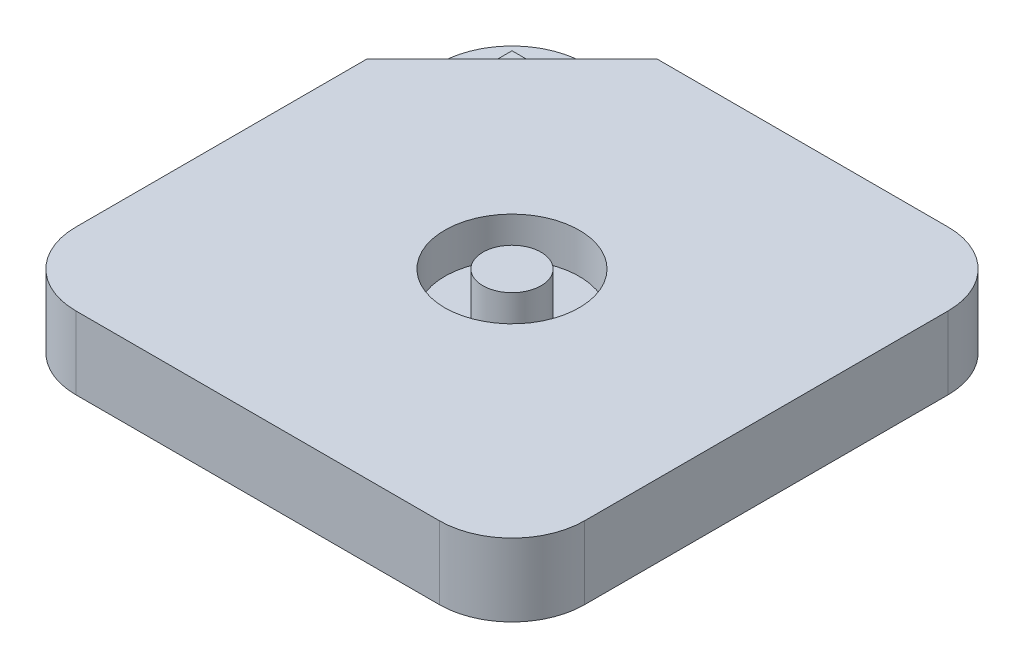
ISO-10303-21;
HEADER;
FILE_DESCRIPTION(('STEP AP214'),'2;1');
FILE_NAME('part.step','',(''),(''),'','','');
FILE_SCHEMA(('AUTOMOTIVE_DESIGN { 1 0 10303 214 1 1 1 1 }'));
ENDSEC;
DATA;
#1=APPLICATION_CONTEXT('core data for automotive mechanical design processes');
#2=APPLICATION_PROTOCOL_DEFINITION('international standard','automotive_design',2000,#1);
#3=PRODUCT_CONTEXT('',#1,'mechanical');
#4=PRODUCT('Part','Part','',(#3));
#5=PRODUCT_RELATED_PRODUCT_CATEGORY('part','',(#4));
#6=PRODUCT_DEFINITION_FORMATION('','',#4);
#7=PRODUCT_DEFINITION_CONTEXT('part definition',#1,'design');
#8=PRODUCT_DEFINITION('design','',#6,#7);
#9=PRODUCT_DEFINITION_SHAPE('','',#8);
#10=(LENGTH_UNIT() NAMED_UNIT(*) SI_UNIT(.MILLI.,.METRE.));
#11=(NAMED_UNIT(*) PLANE_ANGLE_UNIT() SI_UNIT($,.RADIAN.));
#12=(NAMED_UNIT(*) SI_UNIT($,.STERADIAN.) SOLID_ANGLE_UNIT());
#13=UNCERTAINTY_MEASURE_WITH_UNIT(LENGTH_MEASURE(1.E-05),#10,'distance_accuracy_value','');
#14=(GEOMETRIC_REPRESENTATION_CONTEXT(3) GLOBAL_UNCERTAINTY_ASSIGNED_CONTEXT((#13)) GLOBAL_UNIT_ASSIGNED_CONTEXT((#10,
#11,#12)) REPRESENTATION_CONTEXT('',''));
#15=CARTESIAN_POINT('',(0.,0.,0.));
#16=DIRECTION('',(0.,0.,1.));
#17=DIRECTION('',(1.,0.,0.));
#18=AXIS2_PLACEMENT_3D('',#15,#16,#17);
#19=CARTESIAN_POINT('',(-15.,4.5,-35.));
#20=DIRECTION('',(0.707106781186548,0.,0.707106781186548));
#21=DIRECTION('',(0.707106781186548,0.,-0.707106781186548));
#22=AXIS2_PLACEMENT_3D('',#19,#20,#21);
#23=PLANE('',#22);
#24=DIRECTION('',(0.,-1.,0.));
#25=VECTOR('',#24,1.);
#26=CARTESIAN_POINT('',(-23.,9.,-27.));
#27=LINE('',#26,#25);
#28=CARTESIAN_POINT('',(-23.,9.,-27.));
#29=VERTEX_POINT('',#28);
#30=CARTESIAN_POINT('',(-23.,4.5,-27.));
#31=VERTEX_POINT('',#30);
#32=EDGE_CURVE('E148',#29,#31,#27,.T.);
#33=ORIENTED_EDGE('',*,*,#32,.F.);
#34=DIRECTION('',(0.707106781186548,0.,-0.707106781186547));
#35=VECTOR('',#34,1.);
#36=CARTESIAN_POINT('',(-27.,9.,-23.));
#37=LINE('',#36,#35);
#38=CARTESIAN_POINT('',(-27.,9.,-23.));
#39=VERTEX_POINT('',#38);
#40=EDGE_CURVE('E137',#39,#29,#37,.T.);
#41=ORIENTED_EDGE('',*,*,#40,.F.);
#42=DIRECTION('',(0.,-1.,0.));
#43=VECTOR('',#42,1.);
#44=CARTESIAN_POINT('',(-27.,9.,-23.));
#45=LINE('',#44,#43);
#46=CARTESIAN_POINT('',(-27.,4.5,-23.));
#47=VERTEX_POINT('',#46);
#48=EDGE_CURVE('E149',#39,#47,#45,.T.);
#49=ORIENTED_EDGE('',*,*,#48,.T.);
#50=DIRECTION('',(0.707106781186548,0.,-0.707106781186548));
#51=VECTOR('',#50,1.);
#52=CARTESIAN_POINT('',(-15.,4.5,-35.));
#53=LINE('',#52,#51);
#54=CARTESIAN_POINT('',(-35.,4.5,-15.));
#55=VERTEX_POINT('',#54);
#56=EDGE_CURVE('E165',#55,#47,#53,.T.);
#57=ORIENTED_EDGE('',*,*,#56,.F.);
#58=DIRECTION('',(0.,1.,0.));
#59=VECTOR('',#58,1.);
#60=CARTESIAN_POINT('',(-35.,4.5,-15.));
#61=LINE('',#60,#59);
#62=CARTESIAN_POINT('',(-35.,10.,-15.));
#63=VERTEX_POINT('',#62);
#64=EDGE_CURVE('E169',#55,#63,#61,.T.);
#65=ORIENTED_EDGE('',*,*,#64,.T.);
#66=DIRECTION('',(0.707106781186548,0.,-0.707106781186548));
#67=VECTOR('',#66,1.);
#68=CARTESIAN_POINT('',(-15.,10.,-35.));
#69=LINE('',#68,#67);
#70=CARTESIAN_POINT('',(-15.,10.,-35.));
#71=VERTEX_POINT('',#70);
#72=EDGE_CURVE('E161',#63,#71,#69,.T.);
#73=ORIENTED_EDGE('',*,*,#72,.T.);
#74=DIRECTION('',(0.,1.,0.));
#75=VECTOR('',#74,1.);
#76=CARTESIAN_POINT('',(-15.,4.5,-35.));
#77=LINE('',#76,#75);
#78=CARTESIAN_POINT('',(-15.,4.5,-35.));
#79=VERTEX_POINT('',#78);
#80=EDGE_CURVE('E172',#79,#71,#77,.T.);
#81=ORIENTED_EDGE('',*,*,#80,.F.);
#82=EDGE_CURVE('E164',#31,#79,#53,.T.);
#83=ORIENTED_EDGE('',*,*,#82,.F.);
#84=EDGE_LOOP('',(#33,#41,#49,#57,#65,#73,#81,#83));
#85=FACE_BOUND('',#84,.T.);
#86=ADVANCED_FACE('F33',(#85),#23,.F.);
#87=CARTESIAN_POINT('',(0.,4.5,0.));
#88=DIRECTION('',(0.,-1.,0.));
#89=DIRECTION('',(0.,0.,-1.));
#90=AXIS2_PLACEMENT_3D('',#87,#88,#89);
#91=PLANE('',#90);
#92=DIRECTION('',(-1.,0.,0.));
#93=VECTOR('',#92,1.);
#94=CARTESIAN_POINT('',(-35.,4.5,-35.));
#95=LINE('',#94,#93);
#96=CARTESIAN_POINT('',(-25.,4.5,-35.));
#97=VERTEX_POINT('',#96);
#98=EDGE_CURVE('E167',#79,#97,#95,.T.);
#99=ORIENTED_EDGE('',*,*,#98,.T.);
#100=CARTESIAN_POINT('',(-25.,4.5,-25.));
#101=DIRECTION('',(0.,-1.,0.));
#102=DIRECTION('',(0.,0.,-1.));
#103=AXIS2_PLACEMENT_3D('',#100,#101,#102);
#104=CIRCLE('',#103,10.);
#105=CARTESIAN_POINT('',(-35.,4.5,-25.));
#106=VERTEX_POINT('',#105);
#107=EDGE_CURVE('E11',#97,#106,#104,.F.);
#108=ORIENTED_EDGE('',*,*,#107,.T.);
#109=DIRECTION('',(0.,0.,1.));
#110=VECTOR('',#109,1.);
#111=CARTESIAN_POINT('',(-35.,4.5,-15.));
#112=LINE('',#111,#110);
#113=EDGE_CURVE('E162',#106,#55,#112,.T.);
#114=ORIENTED_EDGE('',*,*,#113,.T.);
#115=ORIENTED_EDGE('',*,*,#56,.T.);
#116=DIRECTION('',(0.,0.,1.));
#117=VECTOR('',#116,1.);
#118=CARTESIAN_POINT('',(-27.,4.5,-27.));
#119=LINE('',#118,#117);
#120=CARTESIAN_POINT('',(-27.,4.5,-27.));
#121=VERTEX_POINT('',#120);
#122=EDGE_CURVE('E158',#121,#47,#119,.T.);
#123=ORIENTED_EDGE('',*,*,#122,.F.);
#124=DIRECTION('',(-1.,0.,0.));
#125=VECTOR('',#124,1.);
#126=CARTESIAN_POINT('',(-23.,4.5,-27.));
#127=LINE('',#126,#125);
#128=EDGE_CURVE('E145',#31,#121,#127,.T.);
#129=ORIENTED_EDGE('',*,*,#128,.F.);
#130=ORIENTED_EDGE('',*,*,#82,.T.);
#131=EDGE_LOOP('',(#99,#108,#114,#115,#123,#129,#130));
#132=FACE_BOUND('',#131,.T.);
#133=ADVANCED_FACE('F258',(#132),#91,.F.);
#134=CARTESIAN_POINT('',(35.,10.,-35.));
#135=DIRECTION('',(-1.,0.,0.));
#136=DIRECTION('',(0.,0.,1.));
#137=AXIS2_PLACEMENT_3D('',#134,#135,#136);
#138=PLANE('',#137);
#139=DIRECTION('',(0.,0.,-1.));
#140=VECTOR('',#139,1.);
#141=CARTESIAN_POINT('',(35.,10.,-35.));
#142=LINE('',#141,#140);
#143=CARTESIAN_POINT('',(35.,10.,25.));
#144=VERTEX_POINT('',#143);
#145=CARTESIAN_POINT('',(35.,10.,-25.));
#146=VERTEX_POINT('',#145);
#147=EDGE_CURVE('E189',#144,#146,#142,.T.);
#148=ORIENTED_EDGE('',*,*,#147,.F.);
#149=DIRECTION('',(0.,-1.,0.));
#150=VECTOR('',#149,1.);
#151=CARTESIAN_POINT('',(35.,10.,25.));
#152=LINE('',#151,#150);
#153=CARTESIAN_POINT('',(35.,0.,25.));
#154=VERTEX_POINT('',#153);
#155=EDGE_CURVE('E234',#144,#154,#152,.T.);
#156=ORIENTED_EDGE('',*,*,#155,.T.);
#157=DIRECTION('',(0.,0.,-1.));
#158=VECTOR('',#157,1.);
#159=CARTESIAN_POINT('',(35.,0.,-35.));
#160=LINE('',#159,#158);
#161=CARTESIAN_POINT('',(35.,0.,-25.));
#162=VERTEX_POINT('',#161);
#163=EDGE_CURVE('E186',#154,#162,#160,.T.);
#164=ORIENTED_EDGE('',*,*,#163,.T.);
#165=DIRECTION('',(0.,-1.,0.));
#166=VECTOR('',#165,1.);
#167=CARTESIAN_POINT('',(35.,10.,-25.));
#168=LINE('',#167,#166);
#169=EDGE_CURVE('E232',#162,#146,#168,.F.);
#170=ORIENTED_EDGE('',*,*,#169,.T.);
#171=EDGE_LOOP('',(#148,#156,#164,#170));
#172=FACE_BOUND('',#171,.T.);
#173=ADVANCED_FACE('F279',(#172),#138,.F.);
#174=CARTESIAN_POINT('',(-35.,10.,-35.));
#175=DIRECTION('',(0.,0.,1.));
#176=DIRECTION('',(1.,0.,0.));
#177=AXIS2_PLACEMENT_3D('',#174,#175,#176);
#178=PLANE('',#177);
#179=DIRECTION('',(-1.,0.,0.));
#180=VECTOR('',#179,1.);
#181=CARTESIAN_POINT('',(-35.,10.,-35.));
#182=LINE('',#181,#180);
#183=CARTESIAN_POINT('',(25.,10.,-35.));
#184=VERTEX_POINT('',#183);
#185=EDGE_CURVE('E191',#184,#71,#182,.T.);
#186=ORIENTED_EDGE('',*,*,#185,.F.);
#187=DIRECTION('',(0.,-1.,0.));
#188=VECTOR('',#187,1.);
#189=CARTESIAN_POINT('',(25.,10.,-35.));
#190=LINE('',#189,#188);
#191=CARTESIAN_POINT('',(25.,0.,-35.));
#192=VERTEX_POINT('',#191);
#193=EDGE_CURVE('E41',#184,#192,#190,.T.);
#194=ORIENTED_EDGE('',*,*,#193,.T.);
#195=DIRECTION('',(-1.,0.,0.));
#196=VECTOR('',#195,1.);
#197=CARTESIAN_POINT('',(-35.,0.,-35.));
#198=LINE('',#197,#196);
#199=CARTESIAN_POINT('',(-25.,0.,-35.));
#200=VERTEX_POINT('',#199);
#201=EDGE_CURVE('E203',#192,#200,#198,.T.);
#202=ORIENTED_EDGE('',*,*,#201,.T.);
#203=DIRECTION('',(0.,-1.,0.));
#204=VECTOR('',#203,1.);
#205=CARTESIAN_POINT('',(-25.,10.,-35.));
#206=LINE('',#205,#204);
#207=EDGE_CURVE('E48',#200,#97,#206,.F.);
#208=ORIENTED_EDGE('',*,*,#207,.T.);
#209=ORIENTED_EDGE('',*,*,#98,.F.);
#210=ORIENTED_EDGE('',*,*,#80,.T.);
#211=EDGE_LOOP('',(#186,#194,#202,#208,#209,#210));
#212=FACE_BOUND('',#211,.T.);
#213=ADVANCED_FACE('F240',(#212),#178,.F.);
#214=CARTESIAN_POINT('',(-35.,10.,-35.));
#215=DIRECTION('',(1.,0.,0.));
#216=DIRECTION('',(0.,0.,-1.));
#217=AXIS2_PLACEMENT_3D('',#214,#215,#216);
#218=PLANE('',#217);
#219=DIRECTION('',(0.,0.,1.));
#220=VECTOR('',#219,1.);
#221=CARTESIAN_POINT('',(-35.,0.,-35.));
#222=LINE('',#221,#220);
#223=CARTESIAN_POINT('',(-35.,0.,-25.));
#224=VERTEX_POINT('',#223);
#225=CARTESIAN_POINT('',(-35.,0.,25.));
#226=VERTEX_POINT('',#225);
#227=EDGE_CURVE('E205',#224,#226,#222,.T.);
#228=ORIENTED_EDGE('',*,*,#227,.T.);
#229=DIRECTION('',(0.,-1.,0.));
#230=VECTOR('',#229,1.);
#231=CARTESIAN_POINT('',(-35.,10.,25.));
#232=LINE('',#231,#230);
#233=CARTESIAN_POINT('',(-35.,10.,25.));
#234=VERTEX_POINT('',#233);
#235=EDGE_CURVE('E225',#226,#234,#232,.F.);
#236=ORIENTED_EDGE('',*,*,#235,.T.);
#237=DIRECTION('',(0.,0.,1.));
#238=VECTOR('',#237,1.);
#239=CARTESIAN_POINT('',(-35.,10.,-35.));
#240=LINE('',#239,#238);
#241=EDGE_CURVE('E194',#63,#234,#240,.T.);
#242=ORIENTED_EDGE('',*,*,#241,.F.);
#243=ORIENTED_EDGE('',*,*,#64,.F.);
#244=ORIENTED_EDGE('',*,*,#113,.F.);
#245=DIRECTION('',(0.,-1.,0.));
#246=VECTOR('',#245,1.);
#247=CARTESIAN_POINT('',(-35.,10.,-25.));
#248=LINE('',#247,#246);
#249=EDGE_CURVE('E222',#106,#224,#248,.T.);
#250=ORIENTED_EDGE('',*,*,#249,.T.);
#251=EDGE_LOOP('',(#228,#236,#242,#243,#244,#250));
#252=FACE_BOUND('',#251,.T.);
#253=ADVANCED_FACE('F252',(#252),#218,.F.);
#254=CARTESIAN_POINT('',(-35.,10.,35.));
#255=DIRECTION('',(0.,0.,-1.));
#256=DIRECTION('',(-1.,0.,0.));
#257=AXIS2_PLACEMENT_3D('',#254,#255,#256);
#258=PLANE('',#257);
#259=DIRECTION('',(1.,0.,0.));
#260=VECTOR('',#259,1.);
#261=CARTESIAN_POINT('',(-35.,10.,35.));
#262=LINE('',#261,#260);
#263=CARTESIAN_POINT('',(-25.,10.,35.));
#264=VERTEX_POINT('',#263);
#265=CARTESIAN_POINT('',(25.,10.,35.));
#266=VERTEX_POINT('',#265);
#267=EDGE_CURVE('E197',#264,#266,#262,.T.);
#268=ORIENTED_EDGE('',*,*,#267,.F.);
#269=DIRECTION('',(0.,-1.,0.));
#270=VECTOR('',#269,1.);
#271=CARTESIAN_POINT('',(-25.,10.,35.));
#272=LINE('',#271,#270);
#273=CARTESIAN_POINT('',(-25.,0.,35.));
#274=VERTEX_POINT('',#273);
#275=EDGE_CURVE('E211',#264,#274,#272,.T.);
#276=ORIENTED_EDGE('',*,*,#275,.T.);
#277=DIRECTION('',(1.,0.,0.));
#278=VECTOR('',#277,1.);
#279=CARTESIAN_POINT('',(-35.,0.,35.));
#280=LINE('',#279,#278);
#281=CARTESIAN_POINT('',(25.,0.,35.));
#282=VERTEX_POINT('',#281);
#283=EDGE_CURVE('E192',#274,#282,#280,.T.);
#284=ORIENTED_EDGE('',*,*,#283,.T.);
#285=DIRECTION('',(0.,-1.,0.));
#286=VECTOR('',#285,1.);
#287=CARTESIAN_POINT('',(25.,10.,35.));
#288=LINE('',#287,#286);
#289=EDGE_CURVE('E200',#282,#266,#288,.F.);
#290=ORIENTED_EDGE('',*,*,#289,.T.);
#291=EDGE_LOOP('',(#268,#276,#284,#290));
#292=FACE_BOUND('',#291,.T.);
#293=ADVANCED_FACE('F272',(#292),#258,.F.);
#294=CARTESIAN_POINT('',(0.,10.,0.));
#295=DIRECTION('',(0.,1.,0.));
#296=DIRECTION('',(0.,0.,1.));
#297=AXIS2_PLACEMENT_3D('',#294,#295,#296);
#298=PLANE('',#297);
#299=ORIENTED_EDGE('',*,*,#241,.T.);
#300=CARTESIAN_POINT('',(-25.,10.,25.));
#301=DIRECTION('',(0.,1.,0.));
#302=DIRECTION('',(0.,0.,1.));
#303=AXIS2_PLACEMENT_3D('',#300,#301,#302);
#304=CIRCLE('',#303,10.);
#305=EDGE_CURVE('E230',#234,#264,#304,.T.);
#306=ORIENTED_EDGE('',*,*,#305,.T.);
#307=ORIENTED_EDGE('',*,*,#267,.T.);
#308=CARTESIAN_POINT('',(25.,10.,25.));
#309=DIRECTION('',(0.,1.,0.));
#310=DIRECTION('',(0.,0.,1.));
#311=AXIS2_PLACEMENT_3D('',#308,#309,#310);
#312=CIRCLE('',#311,10.);
#313=EDGE_CURVE('E228',#266,#144,#312,.T.);
#314=ORIENTED_EDGE('',*,*,#313,.T.);
#315=ORIENTED_EDGE('',*,*,#147,.T.);
#316=CARTESIAN_POINT('',(25.,10.,-25.));
#317=DIRECTION('',(0.,1.,0.));
#318=DIRECTION('',(0.,0.,1.));
#319=AXIS2_PLACEMENT_3D('',#316,#317,#318);
#320=CIRCLE('',#319,10.);
#321=EDGE_CURVE('E56',#146,#184,#320,.T.);
#322=ORIENTED_EDGE('',*,*,#321,.T.);
#323=ORIENTED_EDGE('',*,*,#185,.T.);
#324=ORIENTED_EDGE('',*,*,#72,.F.);
#325=EDGE_LOOP('',(#299,#306,#307,#314,#315,#322,#323,#324));
#326=FACE_BOUND('',#325,.T.);
#327=CARTESIAN_POINT('',(0.,10.,0.));
#328=DIRECTION('',(0.,1.,0.));
#329=DIRECTION('',(0.,0.,1.));
#330=AXIS2_PLACEMENT_3D('',#327,#328,#329);
#331=CIRCLE('',#330,9.25);
#332=CARTESIAN_POINT('',(0.,10.,9.25));
#333=VERTEX_POINT('',#332);
#334=EDGE_CURVE('E180',#333,#333,#331,.T.);
#335=ORIENTED_EDGE('',*,*,#334,.F.);
#336=EDGE_LOOP('',(#335));
#337=FACE_BOUND('',#336,.T.);
#338=ADVANCED_FACE('F263',(#326,#337),#298,.T.);
#339=CARTESIAN_POINT('',(0.,0.,0.));
#340=DIRECTION('',(0.,1.,0.));
#341=DIRECTION('',(0.,0.,1.));
#342=AXIS2_PLACEMENT_3D('',#339,#340,#341);
#343=PLANE('',#342);
#344=ORIENTED_EDGE('',*,*,#283,.F.);
#345=CARTESIAN_POINT('',(-25.,0.,25.));
#346=DIRECTION('',(0.,1.,0.));
#347=DIRECTION('',(0.,0.,1.));
#348=AXIS2_PLACEMENT_3D('',#345,#346,#347);
#349=CIRCLE('',#348,10.);
#350=EDGE_CURVE('E220',#274,#226,#349,.F.);
#351=ORIENTED_EDGE('',*,*,#350,.T.);
#352=ORIENTED_EDGE('',*,*,#227,.F.);
#353=CARTESIAN_POINT('',(-25.,0.,-25.));
#354=DIRECTION('',(0.,1.,0.));
#355=DIRECTION('',(0.,0.,1.));
#356=AXIS2_PLACEMENT_3D('',#353,#354,#355);
#357=CIRCLE('',#356,10.);
#358=EDGE_CURVE('E214',#224,#200,#357,.F.);
#359=ORIENTED_EDGE('',*,*,#358,.T.);
#360=ORIENTED_EDGE('',*,*,#201,.F.);
#361=CARTESIAN_POINT('',(25.,0.,-25.));
#362=DIRECTION('',(0.,1.,0.));
#363=DIRECTION('',(0.,0.,1.));
#364=AXIS2_PLACEMENT_3D('',#361,#362,#363);
#365=CIRCLE('',#364,10.);
#366=EDGE_CURVE('E216',#192,#162,#365,.F.);
#367=ORIENTED_EDGE('',*,*,#366,.T.);
#368=ORIENTED_EDGE('',*,*,#163,.F.);
#369=CARTESIAN_POINT('',(25.,0.,25.));
#370=DIRECTION('',(0.,1.,0.));
#371=DIRECTION('',(0.,0.,1.));
#372=AXIS2_PLACEMENT_3D('',#369,#370,#371);
#373=CIRCLE('',#372,10.);
#374=EDGE_CURVE('E218',#154,#282,#373,.F.);
#375=ORIENTED_EDGE('',*,*,#374,.T.);
#376=EDGE_LOOP('',(#344,#351,#352,#359,#360,#367,#368,#375));
#377=FACE_BOUND('',#376,.T.);
#378=ADVANCED_FACE('F244',(#377),#343,.F.);
#379=CARTESIAN_POINT('',(0.,4.5,0.));
#380=DIRECTION('',(0.,1.,0.));
#381=DIRECTION('',(0.,0.,1.));
#382=AXIS2_PLACEMENT_3D('',#379,#380,#381);
#383=CYLINDRICAL_SURFACE('',#382,9.25);
#384=CARTESIAN_POINT('',(0.,4.5,0.));
#385=DIRECTION('',(0.,1.,0.));
#386=DIRECTION('',(0.,0.,1.));
#387=AXIS2_PLACEMENT_3D('',#384,#385,#386);
#388=CIRCLE('',#387,9.25);
#389=CARTESIAN_POINT('',(0.,4.5,9.25));
#390=VERTEX_POINT('',#389);
#391=EDGE_CURVE('E183',#390,#390,#388,.T.);
#392=ORIENTED_EDGE('',*,*,#391,.F.);
#393=EDGE_LOOP('',(#392));
#394=FACE_BOUND('',#393,.T.);
#395=ORIENTED_EDGE('',*,*,#334,.T.);
#396=EDGE_LOOP('',(#395));
#397=FACE_BOUND('',#396,.T.);
#398=ADVANCED_FACE('F308',(#394,#397),#383,.F.);
#399=CARTESIAN_POINT('',(0.,4.5,0.));
#400=DIRECTION('',(0.,1.,0.));
#401=DIRECTION('',(0.,0.,1.));
#402=AXIS2_PLACEMENT_3D('',#399,#400,#401);
#403=PLANE('',#402);
#404=CARTESIAN_POINT('',(0.,4.5,0.));
#405=DIRECTION('',(0.,1.,0.));
#406=DIRECTION('',(0.,0.,1.));
#407=AXIS2_PLACEMENT_3D('',#404,#405,#406);
#408=CIRCLE('',#407,4.);
#409=CARTESIAN_POINT('',(0.,4.5,4.));
#410=VERTEX_POINT('',#409);
#411=EDGE_CURVE('E175',#410,#410,#408,.T.);
#412=ORIENTED_EDGE('',*,*,#411,.F.);
#413=EDGE_LOOP('',(#412));
#414=FACE_BOUND('',#413,.T.);
#415=ORIENTED_EDGE('',*,*,#391,.T.);
#416=EDGE_LOOP('',(#415));
#417=FACE_BOUND('',#416,.T.);
#418=ADVANCED_FACE('F304',(#414,#417),#403,.T.);
#419=CARTESIAN_POINT('',(0.,10.,0.));
#420=DIRECTION('',(0.,-1.,0.));
#421=DIRECTION('',(0.,0.,-1.));
#422=AXIS2_PLACEMENT_3D('',#419,#420,#421);
#423=CYLINDRICAL_SURFACE('',#422,4.);
#424=CARTESIAN_POINT('',(0.,10.,0.));
#425=DIRECTION('',(0.,1.,0.));
#426=DIRECTION('',(0.,0.,1.));
#427=AXIS2_PLACEMENT_3D('',#424,#425,#426);
#428=CIRCLE('',#427,4.);
#429=CARTESIAN_POINT('',(0.,10.,4.));
#430=VERTEX_POINT('',#429);
#431=EDGE_CURVE('E177',#430,#430,#428,.T.);
#432=ORIENTED_EDGE('',*,*,#431,.F.);
#433=EDGE_LOOP('',(#432));
#434=FACE_BOUND('',#433,.T.);
#435=ORIENTED_EDGE('',*,*,#411,.T.);
#436=EDGE_LOOP('',(#435));
#437=FACE_BOUND('',#436,.T.);
#438=ADVANCED_FACE('F300',(#434,#437),#423,.T.);
#439=CARTESIAN_POINT('',(0.,10.,0.));
#440=DIRECTION('',(0.,1.,0.));
#441=DIRECTION('',(0.,0.,1.));
#442=AXIS2_PLACEMENT_3D('',#439,#440,#441);
#443=PLANE('',#442);
#444=ORIENTED_EDGE('',*,*,#431,.T.);
#445=EDGE_LOOP('',(#444));
#446=FACE_BOUND('',#445,.T.);
#447=ADVANCED_FACE('F297',(#446),#443,.T.);
#448=CARTESIAN_POINT('',(-23.,9.,-27.));
#449=DIRECTION('',(0.,0.,1.));
#450=DIRECTION('',(1.,0.,0.));
#451=AXIS2_PLACEMENT_3D('',#448,#449,#450);
#452=PLANE('',#451);
#453=ORIENTED_EDGE('',*,*,#128,.T.);
#454=DIRECTION('',(0.,-1.,0.));
#455=VECTOR('',#454,1.);
#456=CARTESIAN_POINT('',(-27.,9.,-27.));
#457=LINE('',#456,#455);
#458=CARTESIAN_POINT('',(-27.,9.,-27.));
#459=VERTEX_POINT('',#458);
#460=EDGE_CURVE('E143',#459,#121,#457,.T.);
#461=ORIENTED_EDGE('',*,*,#460,.F.);
#462=DIRECTION('',(-1.,0.,0.));
#463=VECTOR('',#462,1.);
#464=CARTESIAN_POINT('',(-23.,9.,-27.));
#465=LINE('',#464,#463);
#466=EDGE_CURVE('E131',#29,#459,#465,.T.);
#467=ORIENTED_EDGE('',*,*,#466,.F.);
#468=ORIENTED_EDGE('',*,*,#32,.T.);
#469=EDGE_LOOP('',(#453,#461,#467,#468));
#470=FACE_BOUND('',#469,.T.);
#471=ADVANCED_FACE('F144',(#470),#452,.F.);
#472=CARTESIAN_POINT('',(-27.,9.,-27.));
#473=DIRECTION('',(1.,0.,0.));
#474=DIRECTION('',(0.,0.,-1.));
#475=AXIS2_PLACEMENT_3D('',#472,#473,#474);
#476=PLANE('',#475);
#477=ORIENTED_EDGE('',*,*,#122,.T.);
#478=ORIENTED_EDGE('',*,*,#48,.F.);
#479=DIRECTION('',(0.,0.,1.));
#480=VECTOR('',#479,1.);
#481=CARTESIAN_POINT('',(-27.,9.,-27.));
#482=LINE('',#481,#480);
#483=EDGE_CURVE('E135',#459,#39,#482,.T.);
#484=ORIENTED_EDGE('',*,*,#483,.F.);
#485=ORIENTED_EDGE('',*,*,#460,.T.);
#486=EDGE_LOOP('',(#477,#478,#484,#485));
#487=FACE_BOUND('',#486,.T.);
#488=ADVANCED_FACE('F151',(#487),#476,.F.);
#489=CARTESIAN_POINT('',(0.,9.,0.));
#490=DIRECTION('',(0.,1.,0.));
#491=DIRECTION('',(0.,0.,1.));
#492=AXIS2_PLACEMENT_3D('',#489,#490,#491);
#493=PLANE('',#492);
#494=ORIENTED_EDGE('',*,*,#40,.T.);
#495=ORIENTED_EDGE('',*,*,#466,.T.);
#496=ORIENTED_EDGE('',*,*,#483,.T.);
#497=EDGE_LOOP('',(#494,#495,#496));
#498=FACE_BOUND('',#497,.T.);
#499=ADVANCED_FACE('F133',(#498),#493,.T.);
#500=CARTESIAN_POINT('',(-25.,10.,25.));
#501=DIRECTION('',(0.,-1.,0.));
#502=DIRECTION('',(0.,0.,-1.));
#503=AXIS2_PLACEMENT_3D('',#500,#501,#502);
#504=CYLINDRICAL_SURFACE('',#503,10.);
#505=ORIENTED_EDGE('',*,*,#305,.F.);
#506=ORIENTED_EDGE('',*,*,#235,.F.);
#507=ORIENTED_EDGE('',*,*,#350,.F.);
#508=ORIENTED_EDGE('',*,*,#275,.F.);
#509=EDGE_LOOP('',(#505,#506,#507,#508));
#510=FACE_BOUND('',#509,.T.);
#511=ADVANCED_FACE('F267',(#510),#504,.T.);
#512=CARTESIAN_POINT('',(25.,10.,25.));
#513=DIRECTION('',(0.,-1.,0.));
#514=DIRECTION('',(0.,0.,-1.));
#515=AXIS2_PLACEMENT_3D('',#512,#513,#514);
#516=CYLINDRICAL_SURFACE('',#515,10.);
#517=ORIENTED_EDGE('',*,*,#313,.F.);
#518=ORIENTED_EDGE('',*,*,#289,.F.);
#519=ORIENTED_EDGE('',*,*,#374,.F.);
#520=ORIENTED_EDGE('',*,*,#155,.F.);
#521=EDGE_LOOP('',(#517,#518,#519,#520));
#522=FACE_BOUND('',#521,.T.);
#523=ADVANCED_FACE('F275',(#522),#516,.T.);
#524=CARTESIAN_POINT('',(25.,10.,-25.));
#525=DIRECTION('',(0.,-1.,0.));
#526=DIRECTION('',(0.,0.,-1.));
#527=AXIS2_PLACEMENT_3D('',#524,#525,#526);
#528=CYLINDRICAL_SURFACE('',#527,10.);
#529=ORIENTED_EDGE('',*,*,#321,.F.);
#530=ORIENTED_EDGE('',*,*,#169,.F.);
#531=ORIENTED_EDGE('',*,*,#366,.F.);
#532=ORIENTED_EDGE('',*,*,#193,.F.);
#533=EDGE_LOOP('',(#529,#530,#531,#532));
#534=FACE_BOUND('',#533,.T.);
#535=ADVANCED_FACE('F281',(#534),#528,.T.);
#536=CARTESIAN_POINT('',(-25.,10.,-25.));
#537=DIRECTION('',(0.,-1.,0.));
#538=DIRECTION('',(0.,0.,-1.));
#539=AXIS2_PLACEMENT_3D('',#536,#537,#538);
#540=CYLINDRICAL_SURFACE('',#539,10.);
#541=ORIENTED_EDGE('',*,*,#107,.F.);
#542=ORIENTED_EDGE('',*,*,#207,.F.);
#543=ORIENTED_EDGE('',*,*,#358,.F.);
#544=ORIENTED_EDGE('',*,*,#249,.F.);
#545=EDGE_LOOP('',(#541,#542,#543,#544));
#546=FACE_BOUND('',#545,.T.);
#547=ADVANCED_FACE('F35',(#546),#540,.T.);
#548=CLOSED_SHELL('',(#86,#133,#173,#213,#253,#293,#338,#378,#398,#418,#438,#447,#471,#488,#499,
#511,#523,#535,#547));
#549=MANIFOLD_SOLID_BREP('B2',#548);
#550=ADVANCED_BREP_SHAPE_REPRESENTATION('',(#18,#549),#14);
#551=SHAPE_DEFINITION_REPRESENTATION(#9,#550);
ENDSEC;
END-ISO-10303-21;
